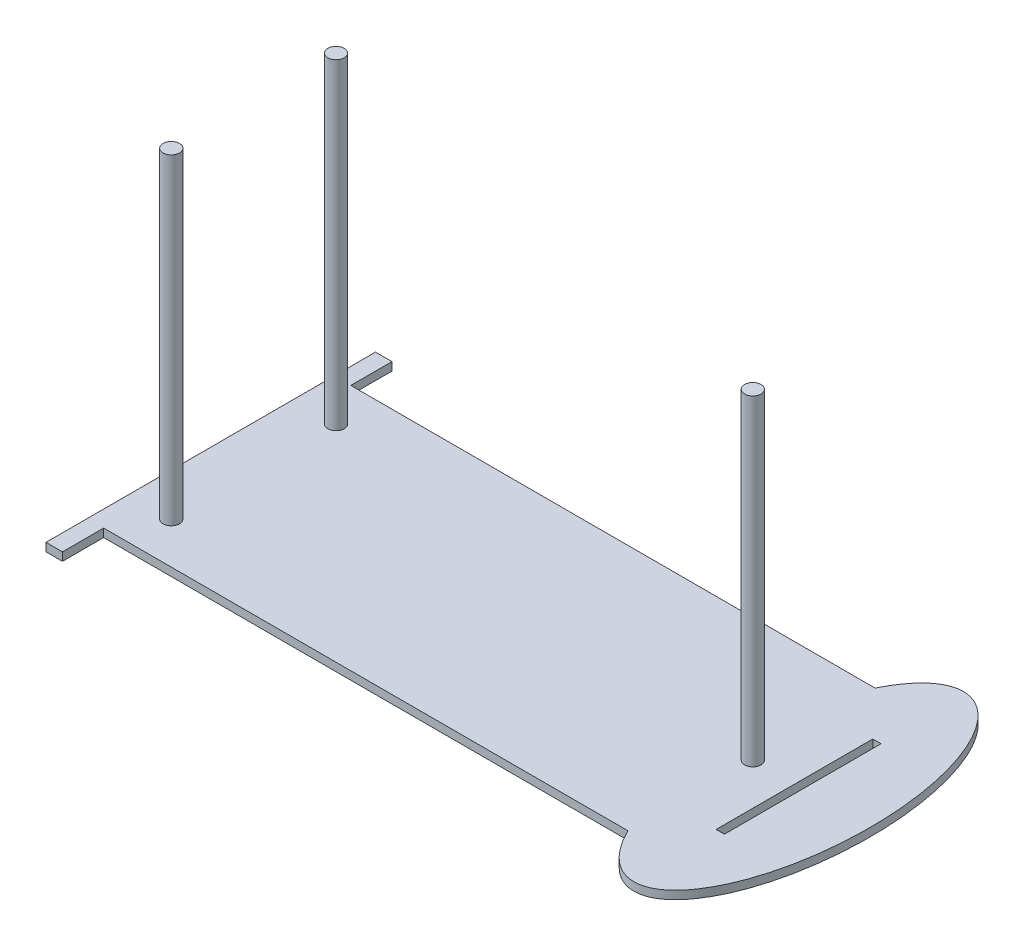
ISO-10303-21;
HEADER;
FILE_DESCRIPTION(('STEP AP214'),'2;1');
FILE_NAME('part.step','',(''),(''),'','','');
FILE_SCHEMA(('AUTOMOTIVE_DESIGN { 1 0 10303 214 1 1 1 1 }'));
ENDSEC;
DATA;
#1=APPLICATION_CONTEXT('core data for automotive mechanical design processes');
#2=APPLICATION_PROTOCOL_DEFINITION('international standard','automotive_design',2000,#1);
#3=PRODUCT_CONTEXT('',#1,'mechanical');
#4=PRODUCT('Part','Part','',(#3));
#5=PRODUCT_RELATED_PRODUCT_CATEGORY('part','',(#4));
#6=PRODUCT_DEFINITION_FORMATION('','',#4);
#7=PRODUCT_DEFINITION_CONTEXT('part definition',#1,'design');
#8=PRODUCT_DEFINITION('design','',#6,#7);
#9=PRODUCT_DEFINITION_SHAPE('','',#8);
#10=(LENGTH_UNIT() NAMED_UNIT(*) SI_UNIT(.MILLI.,.METRE.));
#11=(NAMED_UNIT(*) PLANE_ANGLE_UNIT() SI_UNIT($,.RADIAN.));
#12=(NAMED_UNIT(*) SI_UNIT($,.STERADIAN.) SOLID_ANGLE_UNIT());
#13=UNCERTAINTY_MEASURE_WITH_UNIT(LENGTH_MEASURE(1.E-05),#10,'distance_accuracy_value','');
#14=(GEOMETRIC_REPRESENTATION_CONTEXT(3) GLOBAL_UNCERTAINTY_ASSIGNED_CONTEXT((#13)) GLOBAL_UNIT_ASSIGNED_CONTEXT((#10,
#11,#12)) REPRESENTATION_CONTEXT('',''));
#15=CARTESIAN_POINT('',(0.,0.,0.));
#16=DIRECTION('',(0.,0.,1.));
#17=DIRECTION('',(1.,0.,0.));
#18=AXIS2_PLACEMENT_3D('',#15,#16,#17);
#19=CARTESIAN_POINT('',(0.,2.54,50.0124699151833));
#20=DIRECTION('',(0.,0.,-1.));
#21=DIRECTION('',(-1.,0.,0.));
#22=AXIS2_PLACEMENT_3D('',#19,#20,#21);
#23=PLANE('',#22);
#24=DIRECTION('',(1.,0.,0.));
#25=VECTOR('',#24,1.);
#26=CARTESIAN_POINT('',(0.,0.,50.0124699151833));
#27=LINE('',#26,#25);
#28=CARTESIAN_POINT('',(-83.4403245936978,0.,50.0124699151832));
#29=VERTEX_POINT('',#28);
#30=CARTESIAN_POINT('',(78.2076089260129,0.,50.0124699151833));
#31=VERTEX_POINT('',#30);
#32=EDGE_CURVE('E207',#29,#31,#27,.T.);
#33=ORIENTED_EDGE('',*,*,#32,.T.);
#34=DIRECTION('',(0.,-1.,0.));
#35=VECTOR('',#34,1.);
#36=CARTESIAN_POINT('',(78.2076089260129,2.54,50.0124699151833));
#37=LINE('',#36,#35);
#38=CARTESIAN_POINT('',(78.2076089260129,2.54,50.0124699151833));
#39=VERTEX_POINT('',#38);
#40=EDGE_CURVE('E11',#39,#31,#37,.T.);
#41=ORIENTED_EDGE('',*,*,#40,.F.);
#42=DIRECTION('',(1.,0.,0.));
#43=VECTOR('',#42,1.);
#44=CARTESIAN_POINT('',(0.,2.54,50.0124699151833));
#45=LINE('',#44,#43);
#46=CARTESIAN_POINT('',(-83.4403245936978,2.54,50.0124699151832));
#47=VERTEX_POINT('',#46);
#48=EDGE_CURVE('E280',#47,#39,#45,.T.);
#49=ORIENTED_EDGE('',*,*,#48,.F.);
#50=DIRECTION('',(0.,-1.,0.));
#51=VECTOR('',#50,1.);
#52=CARTESIAN_POINT('',(-83.4403245936978,2.54,50.0124699151832));
#53=LINE('',#52,#51);
#54=EDGE_CURVE('E72',#47,#29,#53,.T.);
#55=ORIENTED_EDGE('',*,*,#54,.T.);
#56=EDGE_LOOP('',(#33,#41,#49,#55));
#57=FACE_BOUND('',#56,.T.);
#58=ADVANCED_FACE('F45',(#57),#23,.F.);
#59=CARTESIAN_POINT('',(92.729511541853,2.54,11.9099618474429));
#60=DIRECTION('',(0.,1.,0.));
#61=DIRECTION('',(0.000114261913464284,0.,-0.999999993472108));
#62=AXIS2_PLACEMENT_3D('',#59,#60,#61);
#63=ELLIPSE('',#62,50.8025083993737,21.9501640077375);
#64=DIRECTION('',(0.,-1.,0.));
#65=VECTOR('',#64,1.);
#66=SURFACE_OF_LINEAR_EXTRUSION('',#63,#65);
#67=CARTESIAN_POINT('',(92.729511541853,0.,11.9099618474429));
#68=DIRECTION('',(0.,1.,0.));
#69=DIRECTION('',(0.000114261913464284,0.,-0.999999993472108));
#70=AXIS2_PLACEMENT_3D('',#67,#68,#69);
#71=ELLIPSE('',#70,50.8025083993737,21.9501640077375);
#72=CARTESIAN_POINT('',(78.2122330524508,0.,-26.1875300848167));
#73=VERTEX_POINT('',#72);
#74=EDGE_CURVE('E210',#31,#73,#71,.T.);
#75=ORIENTED_EDGE('',*,*,#74,.T.);
#76=DIRECTION('',(0.,-1.,0.));
#77=VECTOR('',#76,1.);
#78=CARTESIAN_POINT('',(78.2122330524508,2.54,-26.1875300848167));
#79=LINE('',#78,#77);
#80=CARTESIAN_POINT('',(78.2122330524508,2.54,-26.1875300848167));
#81=VERTEX_POINT('',#80);
#82=EDGE_CURVE('E55',#81,#73,#79,.T.);
#83=ORIENTED_EDGE('',*,*,#82,.F.);
#84=EDGE_CURVE('E285',#39,#81,#63,.T.);
#85=ORIENTED_EDGE('',*,*,#84,.F.);
#86=ORIENTED_EDGE('',*,*,#40,.T.);
#87=EDGE_LOOP('',(#75,#83,#85,#86));
#88=FACE_BOUND('',#87,.T.);
#89=ADVANCED_FACE('F295',(#88),#66,.F.);
#90=CARTESIAN_POINT('',(0.,2.54,-26.1875300848167));
#91=DIRECTION('',(0.,0.,-1.));
#92=DIRECTION('',(-1.,0.,0.));
#93=AXIS2_PLACEMENT_3D('',#90,#91,#92);
#94=PLANE('',#93);
#95=DIRECTION('',(1.,0.,0.));
#96=VECTOR('',#95,1.);
#97=CARTESIAN_POINT('',(0.,0.,-26.1875300848167));
#98=LINE('',#97,#96);
#99=CARTESIAN_POINT('',(-83.4403245936978,0.,-26.1875300848167));
#100=VERTEX_POINT('',#99);
#101=EDGE_CURVE('E214',#100,#73,#98,.T.);
#102=ORIENTED_EDGE('',*,*,#101,.F.);
#103=DIRECTION('',(0.,-1.,0.));
#104=VECTOR('',#103,1.);
#105=CARTESIAN_POINT('',(-83.4403245936978,2.54,-26.1875300848167));
#106=LINE('',#105,#104);
#107=CARTESIAN_POINT('',(-83.4403245936978,2.54,-26.1875300848167));
#108=VERTEX_POINT('',#107);
#109=EDGE_CURVE('E245',#108,#100,#106,.T.);
#110=ORIENTED_EDGE('',*,*,#109,.F.);
#111=DIRECTION('',(1.,0.,0.));
#112=VECTOR('',#111,1.);
#113=CARTESIAN_POINT('',(0.,2.54,-26.1875300848167));
#114=LINE('',#113,#112);
#115=EDGE_CURVE('E293',#108,#81,#114,.T.);
#116=ORIENTED_EDGE('',*,*,#115,.T.);
#117=ORIENTED_EDGE('',*,*,#82,.T.);
#118=EDGE_LOOP('',(#102,#110,#116,#117));
#119=FACE_BOUND('',#118,.T.);
#120=ADVANCED_FACE('F299',(#119),#94,.T.);
#121=CARTESIAN_POINT('',(-83.4403245936978,2.54,0.));
#122=DIRECTION('',(-1.,0.,0.));
#123=DIRECTION('',(0.,0.,1.));
#124=AXIS2_PLACEMENT_3D('',#121,#122,#123);
#125=PLANE('',#124);
#126=DIRECTION('',(0.,0.,-1.));
#127=VECTOR('',#126,1.);
#128=CARTESIAN_POINT('',(-83.4403245936978,0.,0.));
#129=LINE('',#128,#127);
#130=CARTESIAN_POINT('',(-83.4403245936978,0.,-38.8875300848167));
#131=VERTEX_POINT('',#130);
#132=EDGE_CURVE('E218',#100,#131,#129,.T.);
#133=ORIENTED_EDGE('',*,*,#132,.T.);
#134=DIRECTION('',(0.,-1.,0.));
#135=VECTOR('',#134,1.);
#136=CARTESIAN_POINT('',(-83.4403245936978,2.54,-38.8875300848167));
#137=LINE('',#136,#135);
#138=CARTESIAN_POINT('',(-83.4403245936978,2.54,-38.8875300848167));
#139=VERTEX_POINT('',#138);
#140=EDGE_CURVE('E242',#139,#131,#137,.T.);
#141=ORIENTED_EDGE('',*,*,#140,.F.);
#142=DIRECTION('',(0.,0.,-1.));
#143=VECTOR('',#142,1.);
#144=CARTESIAN_POINT('',(-83.4403245936978,2.54,0.));
#145=LINE('',#144,#143);
#146=EDGE_CURVE('E184',#108,#139,#145,.T.);
#147=ORIENTED_EDGE('',*,*,#146,.F.);
#148=ORIENTED_EDGE('',*,*,#109,.T.);
#149=EDGE_LOOP('',(#133,#141,#147,#148));
#150=FACE_BOUND('',#149,.T.);
#151=ADVANCED_FACE('F325',(#150),#125,.F.);
#152=CARTESIAN_POINT('',(0.,2.54,-38.8875300848167));
#153=DIRECTION('',(0.,0.,-1.));
#154=DIRECTION('',(-1.,0.,0.));
#155=AXIS2_PLACEMENT_3D('',#152,#153,#154);
#156=PLANE('',#155);
#157=DIRECTION('',(1.,0.,0.));
#158=VECTOR('',#157,1.);
#159=CARTESIAN_POINT('',(0.,0.,-38.8875300848167));
#160=LINE('',#159,#158);
#161=CARTESIAN_POINT('',(-88.5203245936978,0.,-38.8875300848167));
#162=VERTEX_POINT('',#161);
#163=EDGE_CURVE('E222',#162,#131,#160,.T.);
#164=ORIENTED_EDGE('',*,*,#163,.F.);
#165=DIRECTION('',(0.,-1.,0.));
#166=VECTOR('',#165,1.);
#167=CARTESIAN_POINT('',(-88.5203245936978,2.54,-38.8875300848167));
#168=LINE('',#167,#166);
#169=CARTESIAN_POINT('',(-88.5203245936978,2.54,-38.8875300848167));
#170=VERTEX_POINT('',#169);
#171=EDGE_CURVE('E165',#170,#162,#168,.T.);
#172=ORIENTED_EDGE('',*,*,#171,.F.);
#173=DIRECTION('',(1.,0.,0.));
#174=VECTOR('',#173,1.);
#175=CARTESIAN_POINT('',(0.,2.54,-38.8875300848167));
#176=LINE('',#175,#174);
#177=EDGE_CURVE('E180',#170,#139,#176,.T.);
#178=ORIENTED_EDGE('',*,*,#177,.T.);
#179=ORIENTED_EDGE('',*,*,#140,.T.);
#180=EDGE_LOOP('',(#164,#172,#178,#179));
#181=FACE_BOUND('',#180,.T.);
#182=ADVANCED_FACE('F319',(#181),#156,.T.);
#183=CARTESIAN_POINT('',(-88.5203245936978,2.54,0.));
#184=DIRECTION('',(-1.,0.,0.));
#185=DIRECTION('',(0.,0.,1.));
#186=AXIS2_PLACEMENT_3D('',#183,#184,#185);
#187=PLANE('',#186);
#188=DIRECTION('',(0.,0.,-1.));
#189=VECTOR('',#188,1.);
#190=CARTESIAN_POINT('',(-88.5203245936978,0.,0.));
#191=LINE('',#190,#189);
#192=CARTESIAN_POINT('',(-88.5203245936978,0.,62.7124699151833));
#193=VERTEX_POINT('',#192);
#194=EDGE_CURVE('E160',#193,#162,#191,.T.);
#195=ORIENTED_EDGE('',*,*,#194,.F.);
#196=DIRECTION('',(0.,-1.,0.));
#197=VECTOR('',#196,1.);
#198=CARTESIAN_POINT('',(-88.5203245936978,2.54,62.7124699151833));
#199=LINE('',#198,#197);
#200=CARTESIAN_POINT('',(-88.5203245936978,2.54,62.7124699151833));
#201=VERTEX_POINT('',#200);
#202=EDGE_CURVE('E154',#201,#193,#199,.T.);
#203=ORIENTED_EDGE('',*,*,#202,.F.);
#204=DIRECTION('',(0.,0.,-1.));
#205=VECTOR('',#204,1.);
#206=CARTESIAN_POINT('',(-88.5203245936978,2.54,0.));
#207=LINE('',#206,#205);
#208=EDGE_CURVE('E158',#201,#170,#207,.T.);
#209=ORIENTED_EDGE('',*,*,#208,.T.);
#210=ORIENTED_EDGE('',*,*,#171,.T.);
#211=EDGE_LOOP('',(#195,#203,#209,#210));
#212=FACE_BOUND('',#211,.T.);
#213=ADVANCED_FACE('F156',(#212),#187,.T.);
#214=CARTESIAN_POINT('',(3.42641870231046E-13,2.54,62.7124699151828));
#215=DIRECTION('',(0.,0.,-1.));
#216=DIRECTION('',(-1.,0.,0.));
#217=AXIS2_PLACEMENT_3D('',#214,#215,#216);
#218=PLANE('',#217);
#219=DIRECTION('',(1.,0.,0.));
#220=VECTOR('',#219,1.);
#221=CARTESIAN_POINT('',(3.42641870231046E-13,0.,62.7124699151828));
#222=LINE('',#221,#220);
#223=CARTESIAN_POINT('',(-83.4403245936978,0.,62.7124699151832));
#224=VERTEX_POINT('',#223);
#225=EDGE_CURVE('E228',#193,#224,#222,.T.);
#226=ORIENTED_EDGE('',*,*,#225,.T.);
#227=DIRECTION('',(0.,-1.,0.));
#228=VECTOR('',#227,1.);
#229=CARTESIAN_POINT('',(-83.4403245936978,2.54,62.7124699151832));
#230=LINE('',#229,#228);
#231=CARTESIAN_POINT('',(-83.4403245936978,2.54,62.7124699151832));
#232=VERTEX_POINT('',#231);
#233=EDGE_CURVE('E166',#232,#224,#230,.T.);
#234=ORIENTED_EDGE('',*,*,#233,.F.);
#235=DIRECTION('',(1.,0.,0.));
#236=VECTOR('',#235,1.);
#237=CARTESIAN_POINT('',(3.42641870231046E-13,2.54,62.7124699151828));
#238=LINE('',#237,#236);
#239=EDGE_CURVE('E169',#201,#232,#238,.T.);
#240=ORIENTED_EDGE('',*,*,#239,.F.);
#241=ORIENTED_EDGE('',*,*,#202,.T.);
#242=EDGE_LOOP('',(#226,#234,#240,#241));
#243=FACE_BOUND('',#242,.T.);
#244=ADVANCED_FACE('F170',(#243),#218,.F.);
#245=CARTESIAN_POINT('',(93.999511541853,2.54,0.));
#246=DIRECTION('',(-1.,0.,0.));
#247=DIRECTION('',(0.,0.,1.));
#248=AXIS2_PLACEMENT_3D('',#245,#246,#247);
#249=PLANE('',#248);
#250=DIRECTION('',(0.,0.,-1.));
#251=VECTOR('',#250,1.);
#252=CARTESIAN_POINT('',(93.999511541853,0.,0.));
#253=LINE('',#252,#251);
#254=CARTESIAN_POINT('',(93.999511541853,0.,36.0585681299438));
#255=VERTEX_POINT('',#254);
#256=CARTESIAN_POINT('',(93.999511541853,0.,-12.2386444350582));
#257=VERTEX_POINT('',#256);
#258=EDGE_CURVE('E191',#255,#257,#253,.T.);
#259=ORIENTED_EDGE('',*,*,#258,.F.);
#260=DIRECTION('',(0.,-1.,0.));
#261=VECTOR('',#260,1.);
#262=CARTESIAN_POINT('',(93.999511541853,2.54,36.0585681299438));
#263=LINE('',#262,#261);
#264=CARTESIAN_POINT('',(93.999511541853,2.54,36.0585681299438));
#265=VERTEX_POINT('',#264);
#266=EDGE_CURVE('E49',#265,#255,#263,.T.);
#267=ORIENTED_EDGE('',*,*,#266,.F.);
#268=DIRECTION('',(0.,0.,-1.));
#269=VECTOR('',#268,1.);
#270=CARTESIAN_POINT('',(93.999511541853,2.54,0.));
#271=LINE('',#270,#269);
#272=CARTESIAN_POINT('',(93.999511541853,2.54,-12.2386444350582));
#273=VERTEX_POINT('',#272);
#274=EDGE_CURVE('E235',#265,#273,#271,.T.);
#275=ORIENTED_EDGE('',*,*,#274,.T.);
#276=DIRECTION('',(0.,-1.,0.));
#277=VECTOR('',#276,1.);
#278=CARTESIAN_POINT('',(93.999511541853,2.54,-12.2386444350582));
#279=LINE('',#278,#277);
#280=EDGE_CURVE('E190',#273,#257,#279,.T.);
#281=ORIENTED_EDGE('',*,*,#280,.T.);
#282=EDGE_LOOP('',(#259,#267,#275,#281));
#283=FACE_BOUND('',#282,.T.);
#284=ADVANCED_FACE('F47',(#283),#249,.T.);
#285=CARTESIAN_POINT('',(0.,2.54,36.0585681299438));
#286=DIRECTION('',(0.,0.,-1.));
#287=DIRECTION('',(-1.,0.,0.));
#288=AXIS2_PLACEMENT_3D('',#285,#286,#287);
#289=PLANE('',#288);
#290=DIRECTION('',(1.,0.,0.));
#291=VECTOR('',#290,1.);
#292=CARTESIAN_POINT('',(0.,0.,36.0585681299438));
#293=LINE('',#292,#291);
#294=CARTESIAN_POINT('',(91.459511541853,0.,36.0585681299438));
#295=VERTEX_POINT('',#294);
#296=EDGE_CURVE('E195',#295,#255,#293,.T.);
#297=ORIENTED_EDGE('',*,*,#296,.F.);
#298=DIRECTION('',(0.,-1.,0.));
#299=VECTOR('',#298,1.);
#300=CARTESIAN_POINT('',(91.459511541853,2.54,36.0585681299438));
#301=LINE('',#300,#299);
#302=CARTESIAN_POINT('',(91.459511541853,2.54,36.0585681299438));
#303=VERTEX_POINT('',#302);
#304=EDGE_CURVE('E255',#303,#295,#301,.T.);
#305=ORIENTED_EDGE('',*,*,#304,.F.);
#306=DIRECTION('',(1.,0.,0.));
#307=VECTOR('',#306,1.);
#308=CARTESIAN_POINT('',(0.,2.54,36.0585681299438));
#309=LINE('',#308,#307);
#310=EDGE_CURVE('E266',#303,#265,#309,.T.);
#311=ORIENTED_EDGE('',*,*,#310,.T.);
#312=ORIENTED_EDGE('',*,*,#266,.T.);
#313=EDGE_LOOP('',(#297,#305,#311,#312));
#314=FACE_BOUND('',#313,.T.);
#315=ADVANCED_FACE('F264',(#314),#289,.T.);
#316=CARTESIAN_POINT('',(91.459511541853,2.54,0.));
#317=DIRECTION('',(-1.,0.,0.));
#318=DIRECTION('',(0.,0.,1.));
#319=AXIS2_PLACEMENT_3D('',#316,#317,#318);
#320=PLANE('',#319);
#321=DIRECTION('',(0.,0.,-1.));
#322=VECTOR('',#321,1.);
#323=CARTESIAN_POINT('',(91.459511541853,0.,0.));
#324=LINE('',#323,#322);
#325=CARTESIAN_POINT('',(91.459511541853,0.,-12.2386444350582));
#326=VERTEX_POINT('',#325);
#327=EDGE_CURVE('E200',#295,#326,#324,.T.);
#328=ORIENTED_EDGE('',*,*,#327,.T.);
#329=DIRECTION('',(0.,-1.,0.));
#330=VECTOR('',#329,1.);
#331=CARTESIAN_POINT('',(91.459511541853,2.54,-12.2386444350582));
#332=LINE('',#331,#330);
#333=CARTESIAN_POINT('',(91.459511541853,2.54,-12.2386444350582));
#334=VERTEX_POINT('',#333);
#335=EDGE_CURVE('E252',#334,#326,#332,.T.);
#336=ORIENTED_EDGE('',*,*,#335,.F.);
#337=DIRECTION('',(0.,0.,-1.));
#338=VECTOR('',#337,1.);
#339=CARTESIAN_POINT('',(91.459511541853,2.54,0.));
#340=LINE('',#339,#338);
#341=EDGE_CURVE('E281',#303,#334,#340,.T.);
#342=ORIENTED_EDGE('',*,*,#341,.F.);
#343=ORIENTED_EDGE('',*,*,#304,.T.);
#344=EDGE_LOOP('',(#328,#336,#342,#343));
#345=FACE_BOUND('',#344,.T.);
#346=ADVANCED_FACE('F273',(#345),#320,.F.);
#347=CARTESIAN_POINT('',(0.,2.54,-12.2386444350582));
#348=DIRECTION('',(0.,0.,-1.));
#349=DIRECTION('',(-1.,0.,0.));
#350=AXIS2_PLACEMENT_3D('',#347,#348,#349);
#351=PLANE('',#350);
#352=DIRECTION('',(1.,0.,0.));
#353=VECTOR('',#352,1.);
#354=CARTESIAN_POINT('',(0.,0.,-12.2386444350582));
#355=LINE('',#354,#353);
#356=EDGE_CURVE('E203',#326,#257,#355,.T.);
#357=ORIENTED_EDGE('',*,*,#356,.T.);
#358=ORIENTED_EDGE('',*,*,#280,.F.);
#359=DIRECTION('',(1.,0.,0.));
#360=VECTOR('',#359,1.);
#361=CARTESIAN_POINT('',(0.,2.54,-12.2386444350582));
#362=LINE('',#361,#360);
#363=EDGE_CURVE('E277',#334,#273,#362,.T.);
#364=ORIENTED_EDGE('',*,*,#363,.F.);
#365=ORIENTED_EDGE('',*,*,#335,.T.);
#366=EDGE_LOOP('',(#357,#358,#364,#365));
#367=FACE_BOUND('',#366,.T.);
#368=ADVANCED_FACE('F276',(#367),#351,.F.);
#369=CARTESIAN_POINT('',(-83.4403245936978,2.54,0.));
#370=DIRECTION('',(1.,0.,0.));
#371=DIRECTION('',(0.,0.,-1.));
#372=AXIS2_PLACEMENT_3D('',#369,#370,#371);
#373=PLANE('',#372);
#374=DIRECTION('',(0.,0.,1.));
#375=VECTOR('',#374,1.);
#376=CARTESIAN_POINT('',(-83.4403245936978,0.,0.));
#377=LINE('',#376,#375);
#378=EDGE_CURVE('E231',#29,#224,#377,.T.);
#379=ORIENTED_EDGE('',*,*,#378,.F.);
#380=ORIENTED_EDGE('',*,*,#54,.F.);
#381=DIRECTION('',(0.,0.,1.));
#382=VECTOR('',#381,1.);
#383=CARTESIAN_POINT('',(-83.4403245936978,2.54,0.));
#384=LINE('',#383,#382);
#385=EDGE_CURVE('E174',#47,#232,#384,.T.);
#386=ORIENTED_EDGE('',*,*,#385,.T.);
#387=ORIENTED_EDGE('',*,*,#233,.T.);
#388=EDGE_LOOP('',(#379,#380,#386,#387));
#389=FACE_BOUND('',#388,.T.);
#390=ADVANCED_FACE('F306',(#389),#373,.T.);
#391=CARTESIAN_POINT('',(0.,2.54,0.));
#392=DIRECTION('',(0.,1.,0.));
#393=DIRECTION('',(0.,0.,1.));
#394=AXIS2_PLACEMENT_3D('',#391,#392,#393);
#395=PLANE('',#394);
#396=CARTESIAN_POINT('',(78.6295462822303,2.54,11.9124699151832));
#397=DIRECTION('',(0.,1.,0.));
#398=DIRECTION('',(0.,0.,1.));
#399=AXIS2_PLACEMENT_3D('',#396,#397,#398);
#400=CIRCLE('',#399,2.54);
#401=CARTESIAN_POINT('',(78.6295462822303,2.54,14.4524699151832));
#402=VERTEX_POINT('',#401);
#403=EDGE_CURVE('E455',#402,#402,#400,.T.);
#404=ORIENTED_EDGE('',*,*,#403,.F.);
#405=EDGE_LOOP('',(#404));
#406=FACE_BOUND('',#405,.T.);
#407=CARTESIAN_POINT('',(-75.4035433294448,2.54,37.2012882751422));
#408=DIRECTION('',(0.,1.,0.));
#409=DIRECTION('',(0.,0.,1.));
#410=AXIS2_PLACEMENT_3D('',#407,#408,#409);
#411=CIRCLE('',#410,2.54);
#412=CARTESIAN_POINT('',(-75.4035433294448,2.54,39.7412882751422));
#413=VERTEX_POINT('',#412);
#414=EDGE_CURVE('E463',#413,#413,#411,.T.);
#415=ORIENTED_EDGE('',*,*,#414,.F.);
#416=EDGE_LOOP('',(#415));
#417=FACE_BOUND('',#416,.T.);
#418=CARTESIAN_POINT('',(-75.4035433294448,2.54,-13.6003371034402));
#419=DIRECTION('',(0.,1.,0.));
#420=DIRECTION('',(0.,0.,1.));
#421=AXIS2_PLACEMENT_3D('',#418,#419,#420);
#422=CIRCLE('',#421,2.54);
#423=CARTESIAN_POINT('',(-75.4035433294448,2.54,-11.0603371034402));
#424=VERTEX_POINT('',#423);
#425=EDGE_CURVE('E467',#424,#424,#422,.T.);
#426=ORIENTED_EDGE('',*,*,#425,.F.);
#427=EDGE_LOOP('',(#426));
#428=FACE_BOUND('',#427,.T.);
#429=ORIENTED_EDGE('',*,*,#274,.F.);
#430=ORIENTED_EDGE('',*,*,#310,.F.);
#431=ORIENTED_EDGE('',*,*,#341,.T.);
#432=ORIENTED_EDGE('',*,*,#363,.T.);
#433=EDGE_LOOP('',(#429,#430,#431,#432));
#434=FACE_BOUND('',#433,.T.);
#435=ORIENTED_EDGE('',*,*,#48,.T.);
#436=ORIENTED_EDGE('',*,*,#84,.T.);
#437=ORIENTED_EDGE('',*,*,#115,.F.);
#438=ORIENTED_EDGE('',*,*,#146,.T.);
#439=ORIENTED_EDGE('',*,*,#177,.F.);
#440=ORIENTED_EDGE('',*,*,#208,.F.);
#441=ORIENTED_EDGE('',*,*,#239,.T.);
#442=ORIENTED_EDGE('',*,*,#385,.F.);
#443=EDGE_LOOP('',(#435,#436,#437,#438,#439,#440,#441,#442));
#444=FACE_BOUND('',#443,.T.);
#445=ADVANCED_FACE('F178',(#406,#417,#428,#434,#444),#395,.T.);
#446=CARTESIAN_POINT('',(0.,0.,0.));
#447=DIRECTION('',(0.,1.,0.));
#448=DIRECTION('',(0.,0.,1.));
#449=AXIS2_PLACEMENT_3D('',#446,#447,#448);
#450=PLANE('',#449);
#451=DIRECTION('',(0.,0.,-1.));
#452=VECTOR('',#451,1.);
#453=CARTESIAN_POINT('',(-42.2005765092345,0.,39.4714699151832));
#454=LINE('',#453,#452);
#455=CARTESIAN_POINT('',(-42.2005765092345,0.,39.4714699151832));
#456=VERTEX_POINT('',#455);
#457=CARTESIAN_POINT('',(-42.2005765092345,0.,-15.6465300848168));
#458=VERTEX_POINT('',#457);
#459=EDGE_CURVE('E418',#456,#458,#454,.T.);
#460=ORIENTED_EDGE('',*,*,#459,.F.);
#461=DIRECTION('',(1.,0.,0.));
#462=VECTOR('',#461,1.);
#463=CARTESIAN_POINT('',(-42.2005765092345,0.,39.4714699151832));
#464=LINE('',#463,#462);
#465=CARTESIAN_POINT('',(37.8094234907655,0.,39.4714699151832));
#466=VERTEX_POINT('',#465);
#467=EDGE_CURVE('E432',#456,#466,#464,.T.);
#468=ORIENTED_EDGE('',*,*,#467,.T.);
#469=DIRECTION('',(0.,0.,-1.));
#470=VECTOR('',#469,1.);
#471=CARTESIAN_POINT('',(37.8094234907655,0.,39.4714699151832));
#472=LINE('',#471,#470);
#473=CARTESIAN_POINT('',(37.8094234907655,0.,-15.6465300848168));
#474=VERTEX_POINT('',#473);
#475=EDGE_CURVE('E436',#466,#474,#472,.T.);
#476=ORIENTED_EDGE('',*,*,#475,.T.);
#477=DIRECTION('',(1.,0.,0.));
#478=VECTOR('',#477,1.);
#479=CARTESIAN_POINT('',(-42.2005765092345,0.,-15.6465300848168));
#480=LINE('',#479,#478);
#481=EDGE_CURVE('E63',#458,#474,#480,.T.);
#482=ORIENTED_EDGE('',*,*,#481,.F.);
#483=EDGE_LOOP('',(#460,#468,#476,#482));
#484=FACE_BOUND('',#483,.T.);
#485=ORIENTED_EDGE('',*,*,#258,.T.);
#486=ORIENTED_EDGE('',*,*,#356,.F.);
#487=ORIENTED_EDGE('',*,*,#327,.F.);
#488=ORIENTED_EDGE('',*,*,#296,.T.);
#489=EDGE_LOOP('',(#485,#486,#487,#488));
#490=FACE_BOUND('',#489,.T.);
#491=ORIENTED_EDGE('',*,*,#32,.F.);
#492=ORIENTED_EDGE('',*,*,#378,.T.);
#493=ORIENTED_EDGE('',*,*,#225,.F.);
#494=ORIENTED_EDGE('',*,*,#194,.T.);
#495=ORIENTED_EDGE('',*,*,#163,.T.);
#496=ORIENTED_EDGE('',*,*,#132,.F.);
#497=ORIENTED_EDGE('',*,*,#101,.T.);
#498=ORIENTED_EDGE('',*,*,#74,.F.);
#499=EDGE_LOOP('',(#491,#492,#493,#494,#495,#496,#497,#498));
#500=FACE_BOUND('',#499,.T.);
#501=ADVANCED_FACE('F270',(#484,#490,#500),#450,.F.);
#502=CARTESIAN_POINT('',(-75.4035433294448,101.6,-13.6003371034402));
#503=DIRECTION('',(0.,-1.,0.));
#504=DIRECTION('',(0.,0.,-1.));
#505=AXIS2_PLACEMENT_3D('',#502,#503,#504);
#506=CYLINDRICAL_SURFACE('',#505,2.54);
#507=CARTESIAN_POINT('',(-75.4035433294448,101.6,-13.6003371034402));
#508=DIRECTION('',(0.,1.,0.));
#509=DIRECTION('',(0.,0.,1.));
#510=AXIS2_PLACEMENT_3D('',#507,#508,#509);
#511=CIRCLE('',#510,2.54);
#512=CARTESIAN_POINT('',(-75.4035433294448,101.6,-11.0603371034402));
#513=VERTEX_POINT('',#512);
#514=EDGE_CURVE('E196',#513,#513,#511,.T.);
#515=ORIENTED_EDGE('',*,*,#514,.F.);
#516=EDGE_LOOP('',(#515));
#517=FACE_BOUND('',#516,.T.);
#518=ORIENTED_EDGE('',*,*,#425,.T.);
#519=EDGE_LOOP('',(#518));
#520=FACE_BOUND('',#519,.T.);
#521=ADVANCED_FACE('F353',(#517,#520),#506,.T.);
#522=CARTESIAN_POINT('',(-75.4035433294448,101.6,-13.6003371034402));
#523=DIRECTION('',(0.,1.,0.));
#524=DIRECTION('',(0.,0.,1.));
#525=AXIS2_PLACEMENT_3D('',#522,#523,#524);
#526=PLANE('',#525);
#527=ORIENTED_EDGE('',*,*,#514,.T.);
#528=EDGE_LOOP('',(#527));
#529=FACE_BOUND('',#528,.T.);
#530=ADVANCED_FACE('F360',(#529),#526,.T.);
#531=CARTESIAN_POINT('',(-75.4035433294448,101.6,37.2012882751422));
#532=DIRECTION('',(0.,-1.,0.));
#533=DIRECTION('',(0.,0.,-1.));
#534=AXIS2_PLACEMENT_3D('',#531,#532,#533);
#535=CYLINDRICAL_SURFACE('',#534,2.54);
#536=CARTESIAN_POINT('',(-75.4035433294448,101.6,37.2012882751422));
#537=DIRECTION('',(0.,1.,0.));
#538=DIRECTION('',(0.,0.,1.));
#539=AXIS2_PLACEMENT_3D('',#536,#537,#538);
#540=CIRCLE('',#539,2.54);
#541=CARTESIAN_POINT('',(-75.4035433294448,101.6,39.7412882751422));
#542=VERTEX_POINT('',#541);
#543=EDGE_CURVE('E459',#542,#542,#540,.T.);
#544=ORIENTED_EDGE('',*,*,#543,.F.);
#545=EDGE_LOOP('',(#544));
#546=FACE_BOUND('',#545,.T.);
#547=ORIENTED_EDGE('',*,*,#414,.T.);
#548=EDGE_LOOP('',(#547));
#549=FACE_BOUND('',#548,.T.);
#550=ADVANCED_FACE('F364',(#546,#549),#535,.T.);
#551=CARTESIAN_POINT('',(-75.4035433294448,101.6,37.2012882751422));
#552=DIRECTION('',(0.,1.,0.));
#553=DIRECTION('',(0.,0.,1.));
#554=AXIS2_PLACEMENT_3D('',#551,#552,#553);
#555=PLANE('',#554);
#556=ORIENTED_EDGE('',*,*,#543,.T.);
#557=EDGE_LOOP('',(#556));
#558=FACE_BOUND('',#557,.T.);
#559=ADVANCED_FACE('F366',(#558),#555,.T.);
#560=CARTESIAN_POINT('',(78.6295462822303,101.6,11.9124699151832));
#561=DIRECTION('',(0.,-1.,0.));
#562=DIRECTION('',(0.,0.,-1.));
#563=AXIS2_PLACEMENT_3D('',#560,#561,#562);
#564=CYLINDRICAL_SURFACE('',#563,2.54);
#565=CARTESIAN_POINT('',(78.6295462822303,101.6,11.9124699151832));
#566=DIRECTION('',(0.,1.,0.));
#567=DIRECTION('',(0.,0.,1.));
#568=AXIS2_PLACEMENT_3D('',#565,#566,#567);
#569=CIRCLE('',#568,2.54);
#570=CARTESIAN_POINT('',(78.6295462822303,101.6,14.4524699151832));
#571=VERTEX_POINT('',#570);
#572=EDGE_CURVE('E446',#571,#571,#569,.T.);
#573=ORIENTED_EDGE('',*,*,#572,.F.);
#574=EDGE_LOOP('',(#573));
#575=FACE_BOUND('',#574,.T.);
#576=ORIENTED_EDGE('',*,*,#403,.T.);
#577=EDGE_LOOP('',(#576));
#578=FACE_BOUND('',#577,.T.);
#579=ADVANCED_FACE('F369',(#575,#578),#564,.T.);
#580=CARTESIAN_POINT('',(78.6295462822303,101.6,11.9124699151832));
#581=DIRECTION('',(0.,1.,0.));
#582=DIRECTION('',(0.,0.,1.));
#583=AXIS2_PLACEMENT_3D('',#580,#581,#582);
#584=PLANE('',#583);
#585=ORIENTED_EDGE('',*,*,#572,.T.);
#586=EDGE_LOOP('',(#585));
#587=FACE_BOUND('',#586,.T.);
#588=ADVANCED_FACE('F374',(#587),#584,.T.);
#589=CARTESIAN_POINT('',(-42.2005765092345,-7.62,39.4714699151832));
#590=DIRECTION('',(0.,0.,1.));
#591=DIRECTION('',(1.,0.,0.));
#592=AXIS2_PLACEMENT_3D('',#589,#590,#591);
#593=PLANE('',#592);
#594=ORIENTED_EDGE('',*,*,#467,.F.);
#595=DIRECTION('',(0.,1.,0.));
#596=VECTOR('',#595,1.);
#597=CARTESIAN_POINT('',(-42.2005765092345,-7.62,39.4714699151832));
#598=LINE('',#597,#596);
#599=CARTESIAN_POINT('',(-42.2005765092345,-7.62,39.4714699151832));
#600=VERTEX_POINT('',#599);
#601=EDGE_CURVE('E442',#600,#456,#598,.T.);
#602=ORIENTED_EDGE('',*,*,#601,.F.);
#603=DIRECTION('',(1.,0.,0.));
#604=VECTOR('',#603,1.);
#605=CARTESIAN_POINT('',(-42.2005765092345,-7.62,39.4714699151832));
#606=LINE('',#605,#604);
#607=CARTESIAN_POINT('',(37.8094234907655,-7.62,39.4714699151832));
#608=VERTEX_POINT('',#607);
#609=EDGE_CURVE('E405',#600,#608,#606,.T.);
#610=ORIENTED_EDGE('',*,*,#609,.T.);
#611=DIRECTION('',(0.,1.,0.));
#612=VECTOR('',#611,1.);
#613=CARTESIAN_POINT('',(37.8094234907655,-7.62,39.4714699151832));
#614=LINE('',#613,#612);
#615=EDGE_CURVE('E431',#608,#466,#614,.T.);
#616=ORIENTED_EDGE('',*,*,#615,.T.);
#617=EDGE_LOOP('',(#594,#602,#610,#616));
#618=FACE_BOUND('',#617,.T.);
#619=ADVANCED_FACE('F377',(#618),#593,.T.);
#620=CARTESIAN_POINT('',(-42.2005765092345,-7.62,39.4714699151832));
#621=DIRECTION('',(1.,0.,0.));
#622=DIRECTION('',(0.,0.,-1.));
#623=AXIS2_PLACEMENT_3D('',#620,#621,#622);
#624=PLANE('',#623);
#625=ORIENTED_EDGE('',*,*,#459,.T.);
#626=DIRECTION('',(0.,1.,0.));
#627=VECTOR('',#626,1.);
#628=CARTESIAN_POINT('',(-42.2005765092345,-7.62,-15.6465300848168));
#629=LINE('',#628,#627);
#630=CARTESIAN_POINT('',(-42.2005765092345,-7.62,-15.6465300848168));
#631=VERTEX_POINT('',#630);
#632=EDGE_CURVE('E447',#631,#458,#629,.T.);
#633=ORIENTED_EDGE('',*,*,#632,.F.);
#634=DIRECTION('',(0.,0.,-1.));
#635=VECTOR('',#634,1.);
#636=CARTESIAN_POINT('',(-42.2005765092345,-7.62,39.4714699151832));
#637=LINE('',#636,#635);
#638=EDGE_CURVE('E409',#600,#631,#637,.T.);
#639=ORIENTED_EDGE('',*,*,#638,.F.);
#640=ORIENTED_EDGE('',*,*,#601,.T.);
#641=EDGE_LOOP('',(#625,#633,#639,#640));
#642=FACE_BOUND('',#641,.T.);
#643=ADVANCED_FACE('F384',(#642),#624,.F.);
#644=CARTESIAN_POINT('',(-42.2005765092345,-7.62,-15.6465300848168));
#645=DIRECTION('',(0.,0.,1.));
#646=DIRECTION('',(1.,0.,0.));
#647=AXIS2_PLACEMENT_3D('',#644,#645,#646);
#648=PLANE('',#647);
#649=ORIENTED_EDGE('',*,*,#481,.T.);
#650=DIRECTION('',(0.,1.,0.));
#651=VECTOR('',#650,1.);
#652=CARTESIAN_POINT('',(37.8094234907655,-7.62,-15.6465300848168));
#653=LINE('',#652,#651);
#654=CARTESIAN_POINT('',(37.8094234907655,-7.62,-15.6465300848168));
#655=VERTEX_POINT('',#654);
#656=EDGE_CURVE('E450',#655,#474,#653,.T.);
#657=ORIENTED_EDGE('',*,*,#656,.F.);
#658=DIRECTION('',(1.,0.,0.));
#659=VECTOR('',#658,1.);
#660=CARTESIAN_POINT('',(-42.2005765092345,-7.62,-15.6465300848168));
#661=LINE('',#660,#659);
#662=EDGE_CURVE('E422',#631,#655,#661,.T.);
#663=ORIENTED_EDGE('',*,*,#662,.F.);
#664=ORIENTED_EDGE('',*,*,#632,.T.);
#665=EDGE_LOOP('',(#649,#657,#663,#664));
#666=FACE_BOUND('',#665,.T.);
#667=ADVANCED_FACE('F390',(#666),#648,.F.);
#668=CARTESIAN_POINT('',(37.8094234907655,-7.62,39.4714699151832));
#669=DIRECTION('',(1.,0.,0.));
#670=DIRECTION('',(0.,0.,-1.));
#671=AXIS2_PLACEMENT_3D('',#668,#669,#670);
#672=PLANE('',#671);
#673=ORIENTED_EDGE('',*,*,#475,.F.);
#674=ORIENTED_EDGE('',*,*,#615,.F.);
#675=DIRECTION('',(0.,0.,-1.));
#676=VECTOR('',#675,1.);
#677=CARTESIAN_POINT('',(37.8094234907655,-7.62,39.4714699151832));
#678=LINE('',#677,#676);
#679=EDGE_CURVE('E413',#608,#655,#678,.T.);
#680=ORIENTED_EDGE('',*,*,#679,.T.);
#681=ORIENTED_EDGE('',*,*,#656,.T.);
#682=EDGE_LOOP('',(#673,#674,#680,#681));
#683=FACE_BOUND('',#682,.T.);
#684=ADVANCED_FACE('F386',(#683),#672,.T.);
#685=CARTESIAN_POINT('',(0.,-7.62,0.));
#686=DIRECTION('',(0.,1.,0.));
#687=DIRECTION('',(0.,0.,1.));
#688=AXIS2_PLACEMENT_3D('',#685,#686,#687);
#689=PLANE('',#688);
#690=ORIENTED_EDGE('',*,*,#609,.F.);
#691=ORIENTED_EDGE('',*,*,#638,.T.);
#692=ORIENTED_EDGE('',*,*,#662,.T.);
#693=ORIENTED_EDGE('',*,*,#679,.F.);
#694=EDGE_LOOP('',(#690,#691,#692,#693));
#695=FACE_BOUND('',#694,.T.);
#696=ADVANCED_FACE('F389',(#695),#689,.F.);
#697=CLOSED_SHELL('',(#58,#89,#120,#151,#182,#213,#244,#284,#315,#346,#368,#390,#445,#501,#521,
#530,#550,#559,#579,#588,#619,#643,#667,#684,#696));
#698=MANIFOLD_SOLID_BREP('B2',#697);
#699=ADVANCED_BREP_SHAPE_REPRESENTATION('',(#18,#698),#14);
#700=SHAPE_DEFINITION_REPRESENTATION(#9,#699);
ENDSEC;
END-ISO-10303-21;
